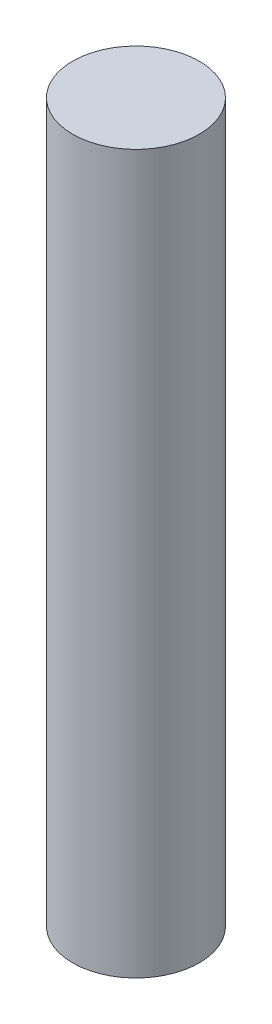
ISO-10303-21;
HEADER;
FILE_DESCRIPTION(('STEP AP214'),'2;1');
FILE_NAME('part.step','',(''),(''),'','','');
FILE_SCHEMA(('AUTOMOTIVE_DESIGN { 1 0 10303 214 1 1 1 1 }'));
ENDSEC;
DATA;
#1=APPLICATION_CONTEXT('core data for automotive mechanical design processes');
#2=APPLICATION_PROTOCOL_DEFINITION('international standard','automotive_design',2000,#1);
#3=PRODUCT_CONTEXT('',#1,'mechanical');
#4=PRODUCT('Part','Part','',(#3));
#5=PRODUCT_RELATED_PRODUCT_CATEGORY('part','',(#4));
#6=PRODUCT_DEFINITION_FORMATION('','',#4);
#7=PRODUCT_DEFINITION_CONTEXT('part definition',#1,'design');
#8=PRODUCT_DEFINITION('design','',#6,#7);
#9=PRODUCT_DEFINITION_SHAPE('','',#8);
#10=(LENGTH_UNIT() NAMED_UNIT(*) SI_UNIT(.MILLI.,.METRE.));
#11=(NAMED_UNIT(*) PLANE_ANGLE_UNIT() SI_UNIT($,.RADIAN.));
#12=(NAMED_UNIT(*) SI_UNIT($,.STERADIAN.) SOLID_ANGLE_UNIT());
#13=UNCERTAINTY_MEASURE_WITH_UNIT(LENGTH_MEASURE(1.E-05),#10,'distance_accuracy_value','');
#14=(GEOMETRIC_REPRESENTATION_CONTEXT(3) GLOBAL_UNCERTAINTY_ASSIGNED_CONTEXT((#13)) GLOBAL_UNIT_ASSIGNED_CONTEXT((#10,
#11,#12)) REPRESENTATION_CONTEXT('',''));
#15=CARTESIAN_POINT('',(0.,0.,0.));
#16=DIRECTION('',(0.,0.,1.));
#17=DIRECTION('',(1.,0.,0.));
#18=AXIS2_PLACEMENT_3D('',#15,#16,#17);
#19=CARTESIAN_POINT('',(0.,17.,0.));
#20=DIRECTION('',(0.,-1.,0.));
#21=DIRECTION('',(0.,0.,-1.));
#22=AXIS2_PLACEMENT_3D('',#19,#20,#21);
#23=CYLINDRICAL_SURFACE('',#22,1.5);
#24=CARTESIAN_POINT('',(0.,17.,0.));
#25=DIRECTION('',(0.,1.,0.));
#26=DIRECTION('',(0.,0.,1.));
#27=AXIS2_PLACEMENT_3D('',#24,#25,#26);
#28=CIRCLE('',#27,1.5);
#29=CARTESIAN_POINT('',(0.,17.,1.5));
#30=VERTEX_POINT('',#29);
#31=EDGE_CURVE('E10',#30,#30,#28,.T.);
#32=ORIENTED_EDGE('',*,*,#31,.F.);
#33=EDGE_LOOP('',(#32));
#34=FACE_BOUND('',#33,.T.);
#35=CARTESIAN_POINT('',(0.,0.,0.));
#36=DIRECTION('',(0.,1.,0.));
#37=DIRECTION('',(0.,0.,1.));
#38=AXIS2_PLACEMENT_3D('',#35,#36,#37);
#39=CIRCLE('',#38,1.5);
#40=CARTESIAN_POINT('',(0.,0.,1.5));
#41=VERTEX_POINT('',#40);
#42=EDGE_CURVE('E33',#41,#41,#39,.T.);
#43=ORIENTED_EDGE('',*,*,#42,.T.);
#44=EDGE_LOOP('',(#43));
#45=FACE_BOUND('',#44,.T.);
#46=ADVANCED_FACE('F30',(#34,#45),#23,.T.);
#47=CARTESIAN_POINT('',(0.,17.,0.));
#48=DIRECTION('',(0.,1.,0.));
#49=DIRECTION('',(0.,0.,1.));
#50=AXIS2_PLACEMENT_3D('',#47,#48,#49);
#51=PLANE('',#50);
#52=ORIENTED_EDGE('',*,*,#31,.T.);
#53=EDGE_LOOP('',(#52));
#54=FACE_BOUND('',#53,.T.);
#55=ADVANCED_FACE('F45',(#54),#51,.T.);
#56=CARTESIAN_POINT('',(0.,0.,0.));
#57=DIRECTION('',(0.,1.,0.));
#58=DIRECTION('',(0.,0.,1.));
#59=AXIS2_PLACEMENT_3D('',#56,#57,#58);
#60=PLANE('',#59);
#61=ORIENTED_EDGE('',*,*,#42,.F.);
#62=EDGE_LOOP('',(#61));
#63=FACE_BOUND('',#62,.T.);
#64=ADVANCED_FACE('F43',(#63),#60,.F.);
#65=CLOSED_SHELL('',(#46,#55,#64));
#66=MANIFOLD_SOLID_BREP('B2',#65);
#67=ADVANCED_BREP_SHAPE_REPRESENTATION('',(#18,#66),#14);
#68=SHAPE_DEFINITION_REPRESENTATION(#9,#67);
ENDSEC;
END-ISO-10303-21;
